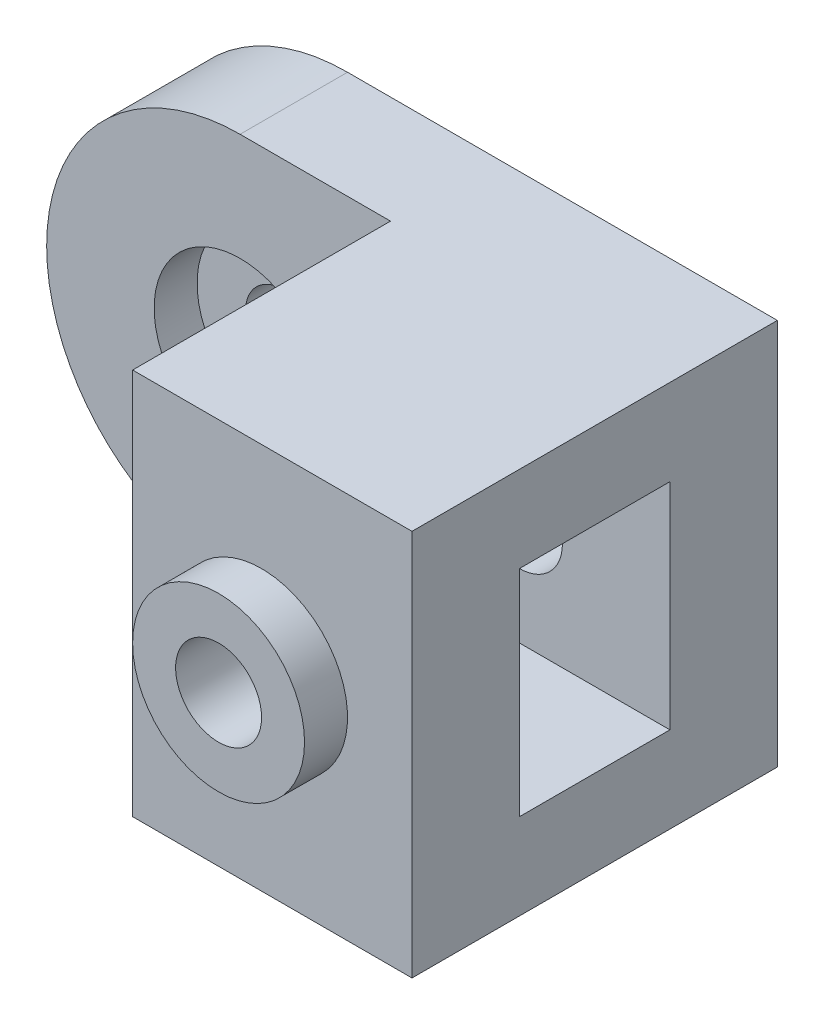
ISO-10303-21;
HEADER;
FILE_DESCRIPTION(('STEP AP214'),'2;1');
FILE_NAME('part.step','',(''),(''),'','','');
FILE_SCHEMA(('AUTOMOTIVE_DESIGN { 1 0 10303 214 1 1 1 1 }'));
ENDSEC;
DATA;
#1=APPLICATION_CONTEXT('core data for automotive mechanical design processes');
#2=APPLICATION_PROTOCOL_DEFINITION('international standard','automotive_design',2000,#1);
#3=PRODUCT_CONTEXT('',#1,'mechanical');
#4=PRODUCT('Part','Part','',(#3));
#5=PRODUCT_RELATED_PRODUCT_CATEGORY('part','',(#4));
#6=PRODUCT_DEFINITION_FORMATION('','',#4);
#7=PRODUCT_DEFINITION_CONTEXT('part definition',#1,'design');
#8=PRODUCT_DEFINITION('design','',#6,#7);
#9=PRODUCT_DEFINITION_SHAPE('','',#8);
#10=(LENGTH_UNIT() NAMED_UNIT(*) SI_UNIT(.MILLI.,.METRE.));
#11=(NAMED_UNIT(*) PLANE_ANGLE_UNIT() SI_UNIT($,.RADIAN.));
#12=(NAMED_UNIT(*) SI_UNIT($,.STERADIAN.) SOLID_ANGLE_UNIT());
#13=UNCERTAINTY_MEASURE_WITH_UNIT(LENGTH_MEASURE(1.E-05),#10,'distance_accuracy_value','');
#14=(GEOMETRIC_REPRESENTATION_CONTEXT(3) GLOBAL_UNCERTAINTY_ASSIGNED_CONTEXT((#13)) GLOBAL_UNIT_ASSIGNED_CONTEXT((#10,
#11,#12)) REPRESENTATION_CONTEXT('',''));
#15=CARTESIAN_POINT('',(0.,0.,0.));
#16=DIRECTION('',(0.,0.,1.));
#17=DIRECTION('',(1.,0.,0.));
#18=AXIS2_PLACEMENT_3D('',#15,#16,#17);
#19=CARTESIAN_POINT('',(177.,70.,60.));
#20=DIRECTION('',(0.,0.,1.));
#21=DIRECTION('',(0.,-1.,0.));
#22=AXIS2_PLACEMENT_3D('',#19,#20,#21);
#23=PLANE('',#22);
#24=DIRECTION('',(-1.,0.,0.));
#25=VECTOR('',#24,1.);
#26=CARTESIAN_POINT('',(177.,20.,60.));
#27=LINE('',#26,#25);
#28=CARTESIAN_POINT('',(145.,20.,60.));
#29=VERTEX_POINT('',#28);
#30=CARTESIAN_POINT('',(80.,20.,60.));
#31=VERTEX_POINT('',#30);
#32=EDGE_CURVE('E53',#29,#31,#27,.T.);
#33=ORIENTED_EDGE('',*,*,#32,.T.);
#34=DIRECTION('',(0.,1.,0.));
#35=VECTOR('',#34,1.);
#36=CARTESIAN_POINT('',(80.,70.,60.));
#37=LINE('',#36,#35);
#38=CARTESIAN_POINT('',(80.,70.,60.));
#39=VERTEX_POINT('',#38);
#40=EDGE_CURVE('E130',#31,#39,#37,.T.);
#41=ORIENTED_EDGE('',*,*,#40,.T.);
#42=DIRECTION('',(-1.,0.,0.));
#43=VECTOR('',#42,1.);
#44=CARTESIAN_POINT('',(177.,70.,60.));
#45=LINE('',#44,#43);
#46=CARTESIAN_POINT('',(145.,70.,60.));
#47=VERTEX_POINT('',#46);
#48=EDGE_CURVE('E256',#47,#39,#45,.T.);
#49=ORIENTED_EDGE('',*,*,#48,.F.);
#50=DIRECTION('',(0.,1.,0.));
#51=VECTOR('',#50,1.);
#52=CARTESIAN_POINT('',(145.,0.,60.));
#53=LINE('',#52,#51);
#54=EDGE_CURVE('E252',#29,#47,#53,.T.);
#55=ORIENTED_EDGE('',*,*,#54,.F.);
#56=EDGE_LOOP('',(#33,#41,#49,#55));
#57=FACE_BOUND('',#56,.T.);
#58=CARTESIAN_POINT('',(110.,45.,60.));
#59=DIRECTION('',(0.,0.,1.));
#60=DIRECTION('',(0.,-1.,0.));
#61=AXIS2_PLACEMENT_3D('',#58,#59,#60);
#62=CIRCLE('',#61,20.);
#63=CARTESIAN_POINT('',(110.,25.,60.));
#64=VERTEX_POINT('',#63);
#65=EDGE_CURVE('E11',#64,#64,#62,.F.);
#66=ORIENTED_EDGE('',*,*,#65,.F.);
#67=EDGE_LOOP('',(#66));
#68=FACE_BOUND('',#67,.T.);
#69=ADVANCED_FACE('F37',(#57,#68),#23,.F.);
#70=CARTESIAN_POINT('',(0.,0.,85.));
#71=DIRECTION('',(0.,0.,-1.));
#72=DIRECTION('',(-1.,0.,0.));
#73=AXIS2_PLACEMENT_3D('',#70,#71,#72);
#74=PLANE('',#73);
#75=DIRECTION('',(0.,-1.,0.));
#76=VECTOR('',#75,1.);
#77=CARTESIAN_POINT('',(80.,0.,85.));
#78=LINE('',#77,#76);
#79=CARTESIAN_POINT('',(80.,90.,85.));
#80=VERTEX_POINT('',#79);
#81=CARTESIAN_POINT('',(80.,0.,85.));
#82=VERTEX_POINT('',#81);
#83=EDGE_CURVE('E141',#80,#82,#78,.T.);
#84=ORIENTED_EDGE('',*,*,#83,.T.);
#85=DIRECTION('',(1.,0.,0.));
#86=VECTOR('',#85,1.);
#87=CARTESIAN_POINT('',(0.,0.,85.));
#88=LINE('',#87,#86);
#89=CARTESIAN_POINT('',(145.,0.,85.));
#90=VERTEX_POINT('',#89);
#91=EDGE_CURVE('E162',#82,#90,#88,.T.);
#92=ORIENTED_EDGE('',*,*,#91,.T.);
#93=DIRECTION('',(0.,1.,0.));
#94=VECTOR('',#93,1.);
#95=CARTESIAN_POINT('',(145.,0.,85.));
#96=LINE('',#95,#94);
#97=CARTESIAN_POINT('',(145.,90.,85.));
#98=VERTEX_POINT('',#97);
#99=EDGE_CURVE('E164',#90,#98,#96,.T.);
#100=ORIENTED_EDGE('',*,*,#99,.T.);
#101=DIRECTION('',(-1.,0.,0.));
#102=VECTOR('',#101,1.);
#103=CARTESIAN_POINT('',(0.,90.,85.));
#104=LINE('',#103,#102);
#105=EDGE_CURVE('E167',#98,#80,#104,.T.);
#106=ORIENTED_EDGE('',*,*,#105,.T.);
#107=EDGE_LOOP('',(#84,#92,#100,#106));
#108=FACE_BOUND('',#107,.T.);
#109=CARTESIAN_POINT('',(110.,45.,85.));
#110=DIRECTION('',(0.,0.,-1.));
#111=DIRECTION('',(-1.,0.,0.));
#112=AXIS2_PLACEMENT_3D('',#109,#110,#111);
#113=CIRCLE('',#112,20.);
#114=CARTESIAN_POINT('',(90.,45.,85.));
#115=VERTEX_POINT('',#114);
#116=EDGE_CURVE('E46',#115,#115,#113,.F.);
#117=ORIENTED_EDGE('',*,*,#116,.F.);
#118=EDGE_LOOP('',(#117));
#119=FACE_BOUND('',#118,.T.);
#120=ADVANCED_FACE('F186',(#108,#119),#74,.F.);
#121=CARTESIAN_POINT('',(45.,45.,35.));
#122=DIRECTION('',(0.,0.,1.));
#123=DIRECTION('',(1.,0.,0.));
#124=AXIS2_PLACEMENT_3D('',#121,#122,#123);
#125=CYLINDRICAL_SURFACE('',#124,8.74999999999998);
#126=CARTESIAN_POINT('',(45.,45.,0.));
#127=DIRECTION('',(0.,0.,-1.));
#128=DIRECTION('',(-1.,0.,0.));
#129=AXIS2_PLACEMENT_3D('',#126,#127,#128);
#130=CIRCLE('',#129,8.74999999999998);
#131=CARTESIAN_POINT('',(36.25,45.,0.));
#132=VERTEX_POINT('',#131);
#133=EDGE_CURVE('E137',#132,#132,#130,.T.);
#134=ORIENTED_EDGE('',*,*,#133,.T.);
#135=EDGE_LOOP('',(#134));
#136=FACE_BOUND('',#135,.T.);
#137=CARTESIAN_POINT('',(45.,45.,15.));
#138=DIRECTION('',(0.,0.,1.));
#139=DIRECTION('',(1.,0.,0.));
#140=AXIS2_PLACEMENT_3D('',#137,#138,#139);
#141=CIRCLE('',#140,8.75);
#142=CARTESIAN_POINT('',(53.75,45.,15.));
#143=VERTEX_POINT('',#142);
#144=EDGE_CURVE('E243',#143,#143,#141,.T.);
#145=ORIENTED_EDGE('',*,*,#144,.T.);
#146=EDGE_LOOP('',(#145));
#147=FACE_BOUND('',#146,.T.);
#148=ADVANCED_FACE('F188',(#136,#147),#125,.F.);
#149=CARTESIAN_POINT('',(45.,45.,0.));
#150=DIRECTION('',(0.,0.,1.));
#151=DIRECTION('',(1.,0.,0.));
#152=AXIS2_PLACEMENT_3D('',#149,#150,#151);
#153=CYLINDRICAL_SURFACE('',#152,45.);
#154=DIRECTION('',(0.,0.,1.));
#155=VECTOR('',#154,1.);
#156=CARTESIAN_POINT('',(45.,0.,0.));
#157=LINE('',#156,#155);
#158=CARTESIAN_POINT('',(45.,0.,0.));
#159=VERTEX_POINT('',#158);
#160=CARTESIAN_POINT('',(45.0000000000005,0.,25.));
#161=VERTEX_POINT('',#160);
#162=EDGE_CURVE('E151',#159,#161,#157,.T.);
#163=ORIENTED_EDGE('',*,*,#162,.T.);
#164=CARTESIAN_POINT('',(45.,45.,25.));
#165=DIRECTION('',(0.,0.,1.));
#166=DIRECTION('',(1.,0.,0.));
#167=AXIS2_PLACEMENT_3D('',#164,#165,#166);
#168=CIRCLE('',#167,45.);
#169=CARTESIAN_POINT('',(45.,90.,25.));
#170=VERTEX_POINT('',#169);
#171=EDGE_CURVE('E235',#170,#161,#168,.T.);
#172=ORIENTED_EDGE('',*,*,#171,.F.);
#173=DIRECTION('',(0.,0.,1.));
#174=VECTOR('',#173,1.);
#175=CARTESIAN_POINT('',(45.,90.,0.));
#176=LINE('',#175,#174);
#177=CARTESIAN_POINT('',(45.,90.,0.));
#178=VERTEX_POINT('',#177);
#179=EDGE_CURVE('E158',#178,#170,#176,.T.);
#180=ORIENTED_EDGE('',*,*,#179,.F.);
#181=CARTESIAN_POINT('',(45.,45.,0.));
#182=DIRECTION('',(0.,0.,1.));
#183=DIRECTION('',(1.,0.,0.));
#184=AXIS2_PLACEMENT_3D('',#181,#182,#183);
#185=CIRCLE('',#184,45.);
#186=EDGE_CURVE('E156',#178,#159,#185,.T.);
#187=ORIENTED_EDGE('',*,*,#186,.T.);
#188=EDGE_LOOP('',(#163,#172,#180,#187));
#189=FACE_BOUND('',#188,.T.);
#190=ADVANCED_FACE('F195',(#189),#153,.T.);
#191=CARTESIAN_POINT('',(0.,0.,85.));
#192=DIRECTION('',(0.,1.,0.));
#193=DIRECTION('',(0.,0.,1.));
#194=AXIS2_PLACEMENT_3D('',#191,#192,#193);
#195=PLANE('',#194);
#196=DIRECTION('',(0.,0.,1.));
#197=VECTOR('',#196,1.);
#198=CARTESIAN_POINT('',(80.,0.,35.));
#199=LINE('',#198,#197);
#200=CARTESIAN_POINT('',(80.,0.,25.));
#201=VERTEX_POINT('',#200);
#202=EDGE_CURVE('E149',#201,#82,#199,.T.);
#203=ORIENTED_EDGE('',*,*,#202,.F.);
#204=DIRECTION('',(1.,0.,0.));
#205=VECTOR('',#204,1.);
#206=CARTESIAN_POINT('',(80.,0.,25.));
#207=LINE('',#206,#205);
#208=EDGE_CURVE('E136',#161,#201,#207,.T.);
#209=ORIENTED_EDGE('',*,*,#208,.F.);
#210=ORIENTED_EDGE('',*,*,#162,.F.);
#211=DIRECTION('',(1.,0.,0.));
#212=VECTOR('',#211,1.);
#213=CARTESIAN_POINT('',(0.,0.,0.));
#214=LINE('',#213,#212);
#215=CARTESIAN_POINT('',(145.,0.,0.));
#216=VERTEX_POINT('',#215);
#217=EDGE_CURVE('E161',#159,#216,#214,.T.);
#218=ORIENTED_EDGE('',*,*,#217,.T.);
#219=DIRECTION('',(0.,0.,-1.));
#220=VECTOR('',#219,1.);
#221=CARTESIAN_POINT('',(145.,0.,85.));
#222=LINE('',#221,#220);
#223=EDGE_CURVE('E178',#90,#216,#222,.T.);
#224=ORIENTED_EDGE('',*,*,#223,.F.);
#225=ORIENTED_EDGE('',*,*,#91,.F.);
#226=EDGE_LOOP('',(#203,#209,#210,#218,#224,#225));
#227=FACE_BOUND('',#226,.T.);
#228=ADVANCED_FACE('F39',(#227),#195,.F.);
#229=CARTESIAN_POINT('',(0.,90.,85.));
#230=DIRECTION('',(0.,-1.,0.));
#231=DIRECTION('',(0.,0.,-1.));
#232=AXIS2_PLACEMENT_3D('',#229,#230,#231);
#233=PLANE('',#232);
#234=DIRECTION('',(-1.,0.,0.));
#235=VECTOR('',#234,1.);
#236=CARTESIAN_POINT('',(45.,90.,25.));
#237=LINE('',#236,#235);
#238=CARTESIAN_POINT('',(80.,90.,25.));
#239=VERTEX_POINT('',#238);
#240=EDGE_CURVE('E236',#239,#170,#237,.T.);
#241=ORIENTED_EDGE('',*,*,#240,.F.);
#242=DIRECTION('',(0.,0.,1.));
#243=VECTOR('',#242,1.);
#244=CARTESIAN_POINT('',(80.,90.,35.));
#245=LINE('',#244,#243);
#246=EDGE_CURVE('E148',#239,#80,#245,.T.);
#247=ORIENTED_EDGE('',*,*,#246,.T.);
#248=ORIENTED_EDGE('',*,*,#105,.F.);
#249=DIRECTION('',(0.,0.,-1.));
#250=VECTOR('',#249,1.);
#251=CARTESIAN_POINT('',(145.,90.,85.));
#252=LINE('',#251,#250);
#253=CARTESIAN_POINT('',(145.,90.,0.));
#254=VERTEX_POINT('',#253);
#255=EDGE_CURVE('E170',#98,#254,#252,.T.);
#256=ORIENTED_EDGE('',*,*,#255,.T.);
#257=DIRECTION('',(-1.,0.,0.));
#258=VECTOR('',#257,1.);
#259=CARTESIAN_POINT('',(0.,90.,0.));
#260=LINE('',#259,#258);
#261=EDGE_CURVE('E165',#254,#178,#260,.T.);
#262=ORIENTED_EDGE('',*,*,#261,.T.);
#263=ORIENTED_EDGE('',*,*,#179,.T.);
#264=EDGE_LOOP('',(#241,#247,#248,#256,#262,#263));
#265=FACE_BOUND('',#264,.T.);
#266=ADVANCED_FACE('F207',(#265),#233,.F.);
#267=CARTESIAN_POINT('',(0.,0.,0.));
#268=DIRECTION('',(0.,0.,-1.));
#269=DIRECTION('',(-1.,0.,0.));
#270=AXIS2_PLACEMENT_3D('',#267,#268,#269);
#271=PLANE('',#270);
#272=CARTESIAN_POINT('',(110.,45.,0.));
#273=DIRECTION('',(0.,0.,-1.));
#274=DIRECTION('',(-1.,0.,0.));
#275=AXIS2_PLACEMENT_3D('',#272,#273,#274);
#276=CIRCLE('',#275,9.99999999999999);
#277=CARTESIAN_POINT('',(100.,45.,0.));
#278=VERTEX_POINT('',#277);
#279=EDGE_CURVE('E269',#278,#278,#276,.T.);
#280=ORIENTED_EDGE('',*,*,#279,.F.);
#281=EDGE_LOOP('',(#280));
#282=FACE_BOUND('',#281,.T.);
#283=ORIENTED_EDGE('',*,*,#133,.F.);
#284=EDGE_LOOP('',(#283));
#285=FACE_BOUND('',#284,.T.);
#286=ORIENTED_EDGE('',*,*,#217,.F.);
#287=ORIENTED_EDGE('',*,*,#186,.F.);
#288=ORIENTED_EDGE('',*,*,#261,.F.);
#289=DIRECTION('',(0.,1.,0.));
#290=VECTOR('',#289,1.);
#291=CARTESIAN_POINT('',(145.,0.,0.));
#292=LINE('',#291,#290);
#293=EDGE_CURVE('E172',#216,#254,#292,.T.);
#294=ORIENTED_EDGE('',*,*,#293,.F.);
#295=EDGE_LOOP('',(#286,#287,#288,#294));
#296=FACE_BOUND('',#295,.T.);
#297=ADVANCED_FACE('F203',(#282,#285,#296),#271,.T.);
#298=CARTESIAN_POINT('',(145.,0.,85.));
#299=DIRECTION('',(-1.,0.,0.));
#300=DIRECTION('',(0.,0.,1.));
#301=AXIS2_PLACEMENT_3D('',#298,#299,#300);
#302=PLANE('',#301);
#303=DIRECTION('',(0.,0.,-1.));
#304=VECTOR('',#303,1.);
#305=CARTESIAN_POINT('',(145.,70.,85.));
#306=LINE('',#305,#304);
#307=CARTESIAN_POINT('',(145.,70.,25.));
#308=VERTEX_POINT('',#307);
#309=EDGE_CURVE('E219',#47,#308,#306,.T.);
#310=ORIENTED_EDGE('',*,*,#309,.T.);
#311=DIRECTION('',(0.,-1.,0.));
#312=VECTOR('',#311,1.);
#313=CARTESIAN_POINT('',(145.,0.,25.));
#314=LINE('',#313,#312);
#315=CARTESIAN_POINT('',(145.,20.,25.));
#316=VERTEX_POINT('',#315);
#317=EDGE_CURVE('E250',#308,#316,#314,.T.);
#318=ORIENTED_EDGE('',*,*,#317,.T.);
#319=DIRECTION('',(0.,0.,1.));
#320=VECTOR('',#319,1.);
#321=CARTESIAN_POINT('',(145.,20.,85.));
#322=LINE('',#321,#320);
#323=EDGE_CURVE('E120',#316,#29,#322,.T.);
#324=ORIENTED_EDGE('',*,*,#323,.T.);
#325=ORIENTED_EDGE('',*,*,#54,.T.);
#326=EDGE_LOOP('',(#310,#318,#324,#325));
#327=FACE_BOUND('',#326,.T.);
#328=ORIENTED_EDGE('',*,*,#293,.T.);
#329=ORIENTED_EDGE('',*,*,#255,.F.);
#330=ORIENTED_EDGE('',*,*,#99,.F.);
#331=ORIENTED_EDGE('',*,*,#223,.T.);
#332=EDGE_LOOP('',(#328,#329,#330,#331));
#333=FACE_BOUND('',#332,.T.);
#334=ADVANCED_FACE('F206',(#327,#333),#302,.F.);
#335=CARTESIAN_POINT('',(80.,0.,35.));
#336=DIRECTION('',(-1.,0.,0.));
#337=DIRECTION('',(0.,-1.,0.));
#338=AXIS2_PLACEMENT_3D('',#335,#336,#337);
#339=PLANE('',#338);
#340=DIRECTION('',(0.,0.,-1.));
#341=VECTOR('',#340,1.);
#342=CARTESIAN_POINT('',(80.,70.,25.));
#343=LINE('',#342,#341);
#344=CARTESIAN_POINT('',(80.,70.,25.));
#345=VERTEX_POINT('',#344);
#346=EDGE_CURVE('E61',#39,#345,#343,.T.);
#347=ORIENTED_EDGE('',*,*,#346,.F.);
#348=ORIENTED_EDGE('',*,*,#40,.F.);
#349=DIRECTION('',(0.,0.,1.));
#350=VECTOR('',#349,1.);
#351=CARTESIAN_POINT('',(80.,20.,25.));
#352=LINE('',#351,#350);
#353=CARTESIAN_POINT('',(80.,20.,25.));
#354=VERTEX_POINT('',#353);
#355=EDGE_CURVE('E117',#354,#31,#352,.T.);
#356=ORIENTED_EDGE('',*,*,#355,.F.);
#357=DIRECTION('',(0.,1.,0.));
#358=VECTOR('',#357,1.);
#359=CARTESIAN_POINT('',(80.,90.,25.));
#360=LINE('',#359,#358);
#361=EDGE_CURVE('E128',#201,#354,#360,.T.);
#362=ORIENTED_EDGE('',*,*,#361,.F.);
#363=ORIENTED_EDGE('',*,*,#202,.T.);
#364=ORIENTED_EDGE('',*,*,#83,.F.);
#365=ORIENTED_EDGE('',*,*,#246,.F.);
#366=EDGE_CURVE('E138',#345,#239,#360,.T.);
#367=ORIENTED_EDGE('',*,*,#366,.F.);
#368=EDGE_LOOP('',(#347,#348,#356,#362,#363,#364,#365,#367));
#369=FACE_BOUND('',#368,.T.);
#370=ADVANCED_FACE('F127',(#369),#339,.T.);
#371=CARTESIAN_POINT('',(45.,45.,25.));
#372=DIRECTION('',(0.,0.,1.));
#373=DIRECTION('',(1.,0.,0.));
#374=AXIS2_PLACEMENT_3D('',#371,#372,#373);
#375=PLANE('',#374);
#376=CARTESIAN_POINT('',(110.,45.,25.));
#377=DIRECTION('',(0.,0.,1.));
#378=DIRECTION('',(1.,0.,0.));
#379=AXIS2_PLACEMENT_3D('',#376,#377,#378);
#380=CIRCLE('',#379,9.99999999999999);
#381=CARTESIAN_POINT('',(120.,45.,25.));
#382=VERTEX_POINT('',#381);
#383=EDGE_CURVE('E272',#382,#382,#380,.T.);
#384=ORIENTED_EDGE('',*,*,#383,.F.);
#385=EDGE_LOOP('',(#384));
#386=FACE_BOUND('',#385,.T.);
#387=CARTESIAN_POINT('',(45.,45.,25.));
#388=DIRECTION('',(0.,0.,1.));
#389=DIRECTION('',(1.,0.,0.));
#390=AXIS2_PLACEMENT_3D('',#387,#388,#389);
#391=CIRCLE('',#390,20.);
#392=CARTESIAN_POINT('',(65.,45.,25.));
#393=VERTEX_POINT('',#392);
#394=EDGE_CURVE('E240',#393,#393,#391,.T.);
#395=ORIENTED_EDGE('',*,*,#394,.F.);
#396=EDGE_LOOP('',(#395));
#397=FACE_BOUND('',#396,.T.);
#398=ORIENTED_EDGE('',*,*,#240,.T.);
#399=ORIENTED_EDGE('',*,*,#171,.T.);
#400=ORIENTED_EDGE('',*,*,#208,.T.);
#401=ORIENTED_EDGE('',*,*,#361,.T.);
#402=DIRECTION('',(-1.,0.,0.));
#403=VECTOR('',#402,1.);
#404=CARTESIAN_POINT('',(177.,20.,25.));
#405=LINE('',#404,#403);
#406=EDGE_CURVE('E114',#316,#354,#405,.T.);
#407=ORIENTED_EDGE('',*,*,#406,.F.);
#408=ORIENTED_EDGE('',*,*,#317,.F.);
#409=DIRECTION('',(-1.,0.,0.));
#410=VECTOR('',#409,1.);
#411=CARTESIAN_POINT('',(177.,70.,25.));
#412=LINE('',#411,#410);
#413=EDGE_CURVE('E253',#308,#345,#412,.T.);
#414=ORIENTED_EDGE('',*,*,#413,.T.);
#415=ORIENTED_EDGE('',*,*,#366,.T.);
#416=EDGE_LOOP('',(#398,#399,#400,#401,#407,#408,#414,#415));
#417=FACE_BOUND('',#416,.T.);
#418=ADVANCED_FACE('F134',(#386,#397,#417),#375,.T.);
#419=CARTESIAN_POINT('',(45.,45.,15.));
#420=DIRECTION('',(0.,0.,1.));
#421=DIRECTION('',(1.,0.,0.));
#422=AXIS2_PLACEMENT_3D('',#419,#420,#421);
#423=CYLINDRICAL_SURFACE('',#422,20.);
#424=CARTESIAN_POINT('',(45.,45.,15.));
#425=DIRECTION('',(0.,0.,1.));
#426=DIRECTION('',(1.,0.,0.));
#427=AXIS2_PLACEMENT_3D('',#424,#425,#426);
#428=CIRCLE('',#427,20.);
#429=CARTESIAN_POINT('',(65.,45.,15.));
#430=VERTEX_POINT('',#429);
#431=EDGE_CURVE('E237',#430,#430,#428,.T.);
#432=ORIENTED_EDGE('',*,*,#431,.F.);
#433=EDGE_LOOP('',(#432));
#434=FACE_BOUND('',#433,.T.);
#435=ORIENTED_EDGE('',*,*,#394,.T.);
#436=EDGE_LOOP('',(#435));
#437=FACE_BOUND('',#436,.T.);
#438=ADVANCED_FACE('F318',(#434,#437),#423,.F.);
#439=CARTESIAN_POINT('',(45.,45.,15.));
#440=DIRECTION('',(0.,0.,1.));
#441=DIRECTION('',(1.,0.,0.));
#442=AXIS2_PLACEMENT_3D('',#439,#440,#441);
#443=PLANE('',#442);
#444=ORIENTED_EDGE('',*,*,#431,.T.);
#445=EDGE_LOOP('',(#444));
#446=FACE_BOUND('',#445,.T.);
#447=ORIENTED_EDGE('',*,*,#144,.F.);
#448=EDGE_LOOP('',(#447));
#449=FACE_BOUND('',#448,.T.);
#450=ADVANCED_FACE('F312',(#446,#449),#443,.T.);
#451=CARTESIAN_POINT('',(177.,70.,25.));
#452=DIRECTION('',(0.,1.,0.));
#453=DIRECTION('',(-1.,0.,0.));
#454=AXIS2_PLACEMENT_3D('',#451,#452,#453);
#455=PLANE('',#454);
#456=ORIENTED_EDGE('',*,*,#48,.T.);
#457=ORIENTED_EDGE('',*,*,#346,.T.);
#458=ORIENTED_EDGE('',*,*,#413,.F.);
#459=ORIENTED_EDGE('',*,*,#309,.F.);
#460=EDGE_LOOP('',(#456,#457,#458,#459));
#461=FACE_BOUND('',#460,.T.);
#462=ADVANCED_FACE('F310',(#461),#455,.F.);
#463=CARTESIAN_POINT('',(177.,20.,25.));
#464=DIRECTION('',(0.,-1.,0.));
#465=DIRECTION('',(1.,0.,0.));
#466=AXIS2_PLACEMENT_3D('',#463,#464,#465);
#467=PLANE('',#466);
#468=ORIENTED_EDGE('',*,*,#406,.T.);
#469=ORIENTED_EDGE('',*,*,#355,.T.);
#470=ORIENTED_EDGE('',*,*,#32,.F.);
#471=ORIENTED_EDGE('',*,*,#323,.F.);
#472=EDGE_LOOP('',(#468,#469,#470,#471));
#473=FACE_BOUND('',#472,.T.);
#474=ADVANCED_FACE('F116',(#473),#467,.F.);
#475=CARTESIAN_POINT('',(110.,45.,95.));
#476=DIRECTION('',(0.,0.,1.));
#477=DIRECTION('',(1.,0.,0.));
#478=AXIS2_PLACEMENT_3D('',#475,#476,#477);
#479=PLANE('',#478);
#480=CARTESIAN_POINT('',(110.,45.,95.));
#481=DIRECTION('',(0.,0.,1.));
#482=DIRECTION('',(1.,0.,0.));
#483=AXIS2_PLACEMENT_3D('',#480,#481,#482);
#484=CIRCLE('',#483,20.);
#485=CARTESIAN_POINT('',(130.,45.,95.));
#486=VERTEX_POINT('',#485);
#487=EDGE_CURVE('E131',#486,#486,#484,.T.);
#488=ORIENTED_EDGE('',*,*,#487,.T.);
#489=EDGE_LOOP('',(#488));
#490=FACE_BOUND('',#489,.T.);
#491=CARTESIAN_POINT('',(110.,45.,95.));
#492=DIRECTION('',(0.,0.,1.));
#493=DIRECTION('',(1.,0.,0.));
#494=AXIS2_PLACEMENT_3D('',#491,#492,#493);
#495=CIRCLE('',#494,9.99999999999999);
#496=CARTESIAN_POINT('',(120.,45.,95.));
#497=VERTEX_POINT('',#496);
#498=EDGE_CURVE('E263',#497,#497,#495,.T.);
#499=ORIENTED_EDGE('',*,*,#498,.F.);
#500=EDGE_LOOP('',(#499));
#501=FACE_BOUND('',#500,.T.);
#502=ADVANCED_FACE('F303',(#490,#501),#479,.T.);
#503=CARTESIAN_POINT('',(110.,45.,95.));
#504=DIRECTION('',(0.,0.,-1.));
#505=DIRECTION('',(-1.,0.,0.));
#506=AXIS2_PLACEMENT_3D('',#503,#504,#505);
#507=CYLINDRICAL_SURFACE('',#506,20.);
#508=ORIENTED_EDGE('',*,*,#487,.F.);
#509=EDGE_LOOP('',(#508));
#510=FACE_BOUND('',#509,.T.);
#511=ORIENTED_EDGE('',*,*,#116,.T.);
#512=EDGE_LOOP('',(#511));
#513=FACE_BOUND('',#512,.T.);
#514=ADVANCED_FACE('F184',(#510,#513),#507,.T.);
#515=CARTESIAN_POINT('',(110.,45.,95.));
#516=DIRECTION('',(0.,0.,-1.));
#517=DIRECTION('',(-1.,0.,0.));
#518=AXIS2_PLACEMENT_3D('',#515,#516,#517);
#519=CYLINDRICAL_SURFACE('',#518,9.99999999999999);
#520=ORIENTED_EDGE('',*,*,#498,.T.);
#521=EDGE_LOOP('',(#520));
#522=FACE_BOUND('',#521,.T.);
#523=CARTESIAN_POINT('',(110.,45.,50.));
#524=DIRECTION('',(0.,0.,-1.));
#525=DIRECTION('',(0.,1.,0.));
#526=AXIS2_PLACEMENT_3D('',#523,#524,#525);
#527=CIRCLE('',#526,9.99999999999999);
#528=CARTESIAN_POINT('',(110.,55.,50.));
#529=VERTEX_POINT('',#528);
#530=EDGE_CURVE('E41',#529,#529,#527,.T.);
#531=ORIENTED_EDGE('',*,*,#530,.T.);
#532=EDGE_LOOP('',(#531));
#533=FACE_BOUND('',#532,.T.);
#534=ADVANCED_FACE('F279',(#522,#533),#519,.F.);
#535=CARTESIAN_POINT('',(110.,45.,50.));
#536=DIRECTION('',(0.,0.,-1.));
#537=DIRECTION('',(0.,1.,0.));
#538=AXIS2_PLACEMENT_3D('',#535,#536,#537);
#539=PLANE('',#538);
#540=ORIENTED_EDGE('',*,*,#530,.F.);
#541=EDGE_LOOP('',(#540));
#542=FACE_BOUND('',#541,.T.);
#543=CARTESIAN_POINT('',(110.,45.,50.));
#544=DIRECTION('',(0.,0.,-1.));
#545=DIRECTION('',(0.,1.,0.));
#546=AXIS2_PLACEMENT_3D('',#543,#544,#545);
#547=CIRCLE('',#546,20.);
#548=CARTESIAN_POINT('',(110.,65.,50.));
#549=VERTEX_POINT('',#548);
#550=EDGE_CURVE('E266',#549,#549,#547,.T.);
#551=ORIENTED_EDGE('',*,*,#550,.T.);
#552=EDGE_LOOP('',(#551));
#553=FACE_BOUND('',#552,.T.);
#554=ADVANCED_FACE('F281',(#542,#553),#539,.T.);
#555=CARTESIAN_POINT('',(110.,45.,50.));
#556=DIRECTION('',(0.,0.,1.));
#557=DIRECTION('',(0.,-1.,0.));
#558=AXIS2_PLACEMENT_3D('',#555,#556,#557);
#559=CYLINDRICAL_SURFACE('',#558,20.);
#560=ORIENTED_EDGE('',*,*,#550,.F.);
#561=EDGE_LOOP('',(#560));
#562=FACE_BOUND('',#561,.T.);
#563=ORIENTED_EDGE('',*,*,#65,.T.);
#564=EDGE_LOOP('',(#563));
#565=FACE_BOUND('',#564,.T.);
#566=ADVANCED_FACE('F284',(#562,#565),#559,.T.);
#567=CARTESIAN_POINT('',(110.,45.,-35.));
#568=DIRECTION('',(0.,0.,1.));
#569=DIRECTION('',(1.,0.,0.));
#570=AXIS2_PLACEMENT_3D('',#567,#568,#569);
#571=CYLINDRICAL_SURFACE('',#570,9.99999999999999);
#572=ORIENTED_EDGE('',*,*,#279,.T.);
#573=EDGE_LOOP('',(#572));
#574=FACE_BOUND('',#573,.T.);
#575=ORIENTED_EDGE('',*,*,#383,.T.);
#576=EDGE_LOOP('',(#575));
#577=FACE_BOUND('',#576,.T.);
#578=ADVANCED_FACE('F290',(#574,#577),#571,.F.);
#579=CLOSED_SHELL('',(#69,#120,#148,#190,#228,#266,#297,#334,#370,#418,#438,#450,#462,#474,#502,
#514,#534,#554,#566,#578));
#580=MANIFOLD_SOLID_BREP('B2',#579);
#581=ADVANCED_BREP_SHAPE_REPRESENTATION('',(#18,#580),#14);
#582=SHAPE_DEFINITION_REPRESENTATION(#9,#581);
ENDSEC;
END-ISO-10303-21;
